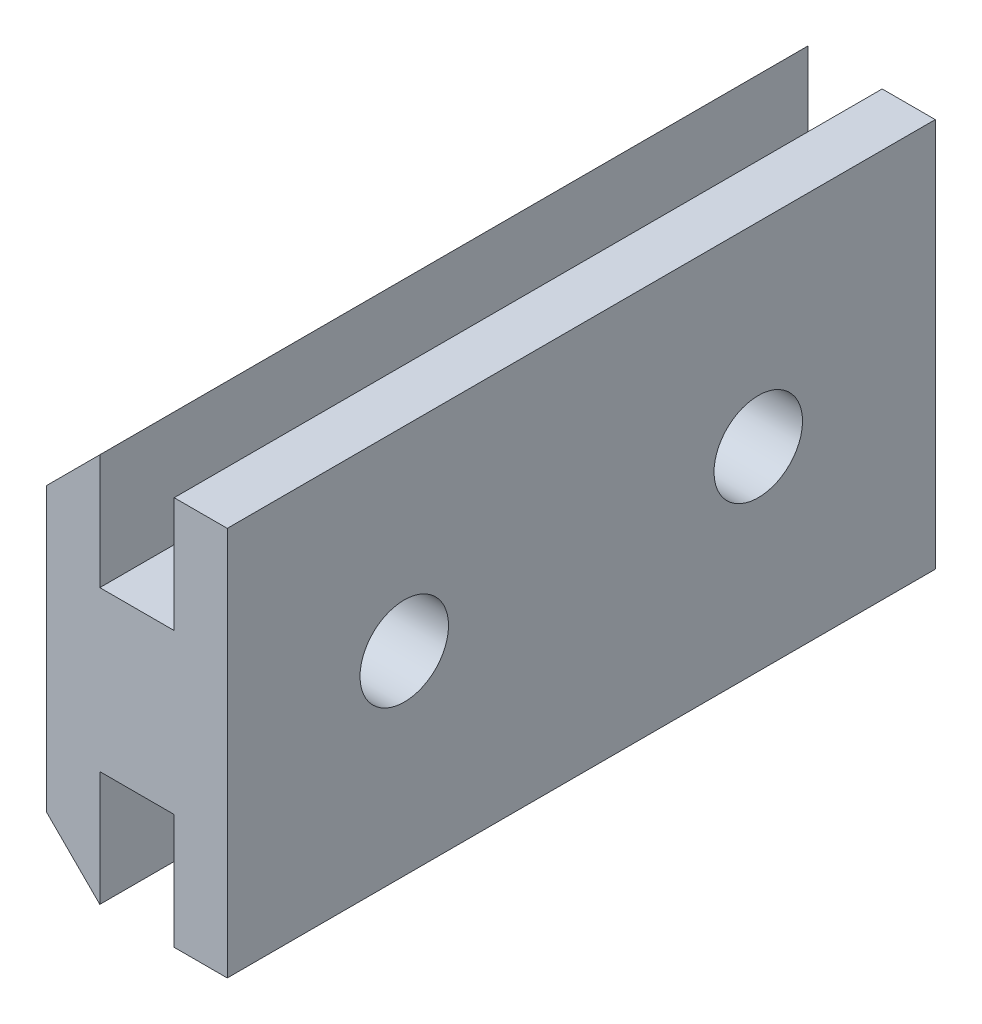
ISO-10303-21;
HEADER;
FILE_DESCRIPTION(('STEP AP214'),'2;1');
FILE_NAME('part.step','',(''),(''),'','','');
FILE_SCHEMA(('AUTOMOTIVE_DESIGN { 1 0 10303 214 1 1 1 1 }'));
ENDSEC;
DATA;
#1=APPLICATION_CONTEXT('core data for automotive mechanical design processes');
#2=APPLICATION_PROTOCOL_DEFINITION('international standard','automotive_design',2000,#1);
#3=PRODUCT_CONTEXT('',#1,'mechanical');
#4=PRODUCT('Part','Part','',(#3));
#5=PRODUCT_RELATED_PRODUCT_CATEGORY('part','',(#4));
#6=PRODUCT_DEFINITION_FORMATION('','',#4);
#7=PRODUCT_DEFINITION_CONTEXT('part definition',#1,'design');
#8=PRODUCT_DEFINITION('design','',#6,#7);
#9=PRODUCT_DEFINITION_SHAPE('','',#8);
#10=(LENGTH_UNIT() NAMED_UNIT(*) SI_UNIT(.MILLI.,.METRE.));
#11=(NAMED_UNIT(*) PLANE_ANGLE_UNIT() SI_UNIT($,.RADIAN.));
#12=(NAMED_UNIT(*) SI_UNIT($,.STERADIAN.) SOLID_ANGLE_UNIT());
#13=UNCERTAINTY_MEASURE_WITH_UNIT(LENGTH_MEASURE(1.E-05),#10,'distance_accuracy_value','');
#14=(GEOMETRIC_REPRESENTATION_CONTEXT(3) GLOBAL_UNCERTAINTY_ASSIGNED_CONTEXT((#13)) GLOBAL_UNIT_ASSIGNED_CONTEXT((#10,
#11,#12)) REPRESENTATION_CONTEXT('',''));
#15=CARTESIAN_POINT('',(0.,0.,0.));
#16=DIRECTION('',(0.,0.,1.));
#17=DIRECTION('',(1.,0.,0.));
#18=AXIS2_PLACEMENT_3D('',#15,#16,#17);
#19=CARTESIAN_POINT('',(0.100000000000002,-1.75000000000001,20.));
#20=DIRECTION('',(0.707106781186546,0.707106781186549,0.));
#21=DIRECTION('',(-0.707106781186549,0.707106781186546,0.));
#22=AXIS2_PLACEMENT_3D('',#19,#20,#21);
#23=PLANE('',#22);
#24=DIRECTION('',(0.707106781186549,-0.707106781186546,0.));
#25=VECTOR('',#24,1.);
#26=CARTESIAN_POINT('',(0.100000000000002,-1.75000000000001,0.));
#27=LINE('',#26,#25);
#28=CARTESIAN_POINT('',(0.100000000000002,-1.75000000000001,0.));
#29=VERTEX_POINT('',#28);
#30=CARTESIAN_POINT('',(1.6,-3.25,0.));
#31=VERTEX_POINT('',#30);
#32=EDGE_CURVE('E153',#29,#31,#27,.T.);
#33=ORIENTED_EDGE('',*,*,#32,.T.);
#34=DIRECTION('',(0.,0.,-1.));
#35=VECTOR('',#34,1.);
#36=CARTESIAN_POINT('',(1.6,-3.25,20.));
#37=LINE('',#36,#35);
#38=CARTESIAN_POINT('',(1.6,-3.25,20.));
#39=VERTEX_POINT('',#38);
#40=EDGE_CURVE('E11',#39,#31,#37,.T.);
#41=ORIENTED_EDGE('',*,*,#40,.F.);
#42=DIRECTION('',(0.707106781186549,-0.707106781186546,0.));
#43=VECTOR('',#42,1.);
#44=CARTESIAN_POINT('',(0.100000000000002,-1.75000000000001,20.));
#45=LINE('',#44,#43);
#46=CARTESIAN_POINT('',(0.100000000000002,-1.75000000000001,20.));
#47=VERTEX_POINT('',#46);
#48=EDGE_CURVE('E176',#47,#39,#45,.T.);
#49=ORIENTED_EDGE('',*,*,#48,.F.);
#50=DIRECTION('',(0.,0.,-1.));
#51=VECTOR('',#50,1.);
#52=CARTESIAN_POINT('',(0.100000000000002,-1.75000000000001,20.));
#53=LINE('',#52,#51);
#54=EDGE_CURVE('E149',#47,#29,#53,.T.);
#55=ORIENTED_EDGE('',*,*,#54,.T.);
#56=EDGE_LOOP('',(#33,#41,#49,#55));
#57=FACE_BOUND('',#56,.T.);
#58=ADVANCED_FACE('F33',(#57),#23,.F.);
#59=CARTESIAN_POINT('',(1.6,0.,20.));
#60=DIRECTION('',(-1.,0.,0.));
#61=DIRECTION('',(0.,-1.,0.));
#62=AXIS2_PLACEMENT_3D('',#59,#60,#61);
#63=PLANE('',#62);
#64=DIRECTION('',(0.,1.,0.));
#65=VECTOR('',#64,1.);
#66=CARTESIAN_POINT('',(1.6,0.,0.));
#67=LINE('',#66,#65);
#68=CARTESIAN_POINT('',(1.6,0.,0.));
#69=VERTEX_POINT('',#68);
#70=EDGE_CURVE('E156',#31,#69,#67,.T.);
#71=ORIENTED_EDGE('',*,*,#70,.T.);
#72=DIRECTION('',(0.,0.,-1.));
#73=VECTOR('',#72,1.);
#74=CARTESIAN_POINT('',(1.6,0.,20.));
#75=LINE('',#74,#73);
#76=CARTESIAN_POINT('',(1.6,0.,20.));
#77=VERTEX_POINT('',#76);
#78=EDGE_CURVE('E41',#77,#69,#75,.T.);
#79=ORIENTED_EDGE('',*,*,#78,.F.);
#80=DIRECTION('',(0.,1.,0.));
#81=VECTOR('',#80,1.);
#82=CARTESIAN_POINT('',(1.6,0.,20.));
#83=LINE('',#82,#81);
#84=EDGE_CURVE('E104',#39,#77,#83,.T.);
#85=ORIENTED_EDGE('',*,*,#84,.F.);
#86=ORIENTED_EDGE('',*,*,#40,.T.);
#87=EDGE_LOOP('',(#71,#79,#85,#86));
#88=FACE_BOUND('',#87,.T.);
#89=ADVANCED_FACE('F257',(#88),#63,.F.);
#90=CARTESIAN_POINT('',(3.7,0.,20.));
#91=DIRECTION('',(0.,1.,0.));
#92=DIRECTION('',(0.,0.,1.));
#93=AXIS2_PLACEMENT_3D('',#90,#91,#92);
#94=PLANE('',#93);
#95=DIRECTION('',(1.,0.,0.));
#96=VECTOR('',#95,1.);
#97=CARTESIAN_POINT('',(3.7,0.,0.));
#98=LINE('',#97,#96);
#99=CARTESIAN_POINT('',(3.7,0.,0.));
#100=VERTEX_POINT('',#99);
#101=EDGE_CURVE('E159',#69,#100,#98,.T.);
#102=ORIENTED_EDGE('',*,*,#101,.T.);
#103=DIRECTION('',(0.,0.,-1.));
#104=VECTOR('',#103,1.);
#105=CARTESIAN_POINT('',(3.7,0.,20.));
#106=LINE('',#105,#104);
#107=CARTESIAN_POINT('',(3.7,0.,20.));
#108=VERTEX_POINT('',#107);
#109=EDGE_CURVE('E195',#108,#100,#106,.T.);
#110=ORIENTED_EDGE('',*,*,#109,.F.);
#111=DIRECTION('',(1.,0.,0.));
#112=VECTOR('',#111,1.);
#113=CARTESIAN_POINT('',(3.7,0.,20.));
#114=LINE('',#113,#112);
#115=EDGE_CURVE('E203',#77,#108,#114,.T.);
#116=ORIENTED_EDGE('',*,*,#115,.F.);
#117=ORIENTED_EDGE('',*,*,#78,.T.);
#118=EDGE_LOOP('',(#102,#110,#116,#117));
#119=FACE_BOUND('',#118,.T.);
#120=ADVANCED_FACE('F201',(#119),#94,.F.);
#121=CARTESIAN_POINT('',(3.7,-3.25,20.));
#122=DIRECTION('',(1.,0.,0.));
#123=DIRECTION('',(0.,0.,-1.));
#124=AXIS2_PLACEMENT_3D('',#121,#122,#123);
#125=PLANE('',#124);
#126=DIRECTION('',(0.,-1.,0.));
#127=VECTOR('',#126,1.);
#128=CARTESIAN_POINT('',(3.7,-3.25,0.));
#129=LINE('',#128,#127);
#130=CARTESIAN_POINT('',(3.7,-3.25,0.));
#131=VERTEX_POINT('',#130);
#132=EDGE_CURVE('E161',#100,#131,#129,.T.);
#133=ORIENTED_EDGE('',*,*,#132,.T.);
#134=DIRECTION('',(0.,0.,-1.));
#135=VECTOR('',#134,1.);
#136=CARTESIAN_POINT('',(3.7,-3.25,20.));
#137=LINE('',#136,#135);
#138=CARTESIAN_POINT('',(3.7,-3.25,20.));
#139=VERTEX_POINT('',#138);
#140=EDGE_CURVE('E192',#139,#131,#137,.T.);
#141=ORIENTED_EDGE('',*,*,#140,.F.);
#142=DIRECTION('',(0.,-1.,0.));
#143=VECTOR('',#142,1.);
#144=CARTESIAN_POINT('',(3.7,-3.25,20.));
#145=LINE('',#144,#143);
#146=EDGE_CURVE('E221',#108,#139,#145,.T.);
#147=ORIENTED_EDGE('',*,*,#146,.F.);
#148=ORIENTED_EDGE('',*,*,#109,.T.);
#149=EDGE_LOOP('',(#133,#141,#147,#148));
#150=FACE_BOUND('',#149,.T.);
#151=ADVANCED_FACE('F212',(#150),#125,.F.);
#152=CARTESIAN_POINT('',(5.2,-3.25,20.));
#153=DIRECTION('',(0.,1.,0.));
#154=DIRECTION('',(0.,0.,1.));
#155=AXIS2_PLACEMENT_3D('',#152,#153,#154);
#156=PLANE('',#155);
#157=DIRECTION('',(1.,0.,0.));
#158=VECTOR('',#157,1.);
#159=CARTESIAN_POINT('',(5.2,-3.25,0.));
#160=LINE('',#159,#158);
#161=CARTESIAN_POINT('',(5.2,-3.25,0.));
#162=VERTEX_POINT('',#161);
#163=EDGE_CURVE('E163',#131,#162,#160,.T.);
#164=ORIENTED_EDGE('',*,*,#163,.T.);
#165=DIRECTION('',(0.,0.,-1.));
#166=VECTOR('',#165,1.);
#167=CARTESIAN_POINT('',(5.2,-3.25,20.));
#168=LINE('',#167,#166);
#169=CARTESIAN_POINT('',(5.2,-3.25,20.));
#170=VERTEX_POINT('',#169);
#171=EDGE_CURVE('E189',#170,#162,#168,.T.);
#172=ORIENTED_EDGE('',*,*,#171,.F.);
#173=DIRECTION('',(1.,0.,0.));
#174=VECTOR('',#173,1.);
#175=CARTESIAN_POINT('',(5.2,-3.25,20.));
#176=LINE('',#175,#174);
#177=EDGE_CURVE('E218',#139,#170,#176,.T.);
#178=ORIENTED_EDGE('',*,*,#177,.F.);
#179=ORIENTED_EDGE('',*,*,#140,.T.);
#180=EDGE_LOOP('',(#164,#172,#178,#179));
#181=FACE_BOUND('',#180,.T.);
#182=ADVANCED_FACE('F216',(#181),#156,.F.);
#183=CARTESIAN_POINT('',(5.2,7.75,20.));
#184=DIRECTION('',(-1.,0.,0.));
#185=DIRECTION('',(0.,-1.,0.));
#186=AXIS2_PLACEMENT_3D('',#183,#184,#185);
#187=PLANE('',#186);
#188=CARTESIAN_POINT('',(5.2,2.25,5.));
#189=DIRECTION('',(1.,0.,0.));
#190=DIRECTION('',(0.,1.,0.));
#191=AXIS2_PLACEMENT_3D('',#188,#189,#190);
#192=CIRCLE('',#191,1.25);
#193=CARTESIAN_POINT('',(5.2,3.5,5.));
#194=VERTEX_POINT('',#193);
#195=EDGE_CURVE('E345',#194,#194,#192,.T.);
#196=ORIENTED_EDGE('',*,*,#195,.F.);
#197=EDGE_LOOP('',(#196));
#198=FACE_BOUND('',#197,.T.);
#199=CARTESIAN_POINT('',(5.2,2.25,15.));
#200=DIRECTION('',(1.,0.,0.));
#201=DIRECTION('',(0.,1.,0.));
#202=AXIS2_PLACEMENT_3D('',#199,#200,#201);
#203=CIRCLE('',#202,1.25);
#204=CARTESIAN_POINT('',(5.2,3.5,15.));
#205=VERTEX_POINT('',#204);
#206=EDGE_CURVE('E347',#205,#205,#203,.T.);
#207=ORIENTED_EDGE('',*,*,#206,.F.);
#208=EDGE_LOOP('',(#207));
#209=FACE_BOUND('',#208,.T.);
#210=DIRECTION('',(0.,1.,0.));
#211=VECTOR('',#210,1.);
#212=CARTESIAN_POINT('',(5.2,7.75,0.));
#213=LINE('',#212,#211);
#214=CARTESIAN_POINT('',(5.2,7.75,0.));
#215=VERTEX_POINT('',#214);
#216=EDGE_CURVE('E165',#162,#215,#213,.T.);
#217=ORIENTED_EDGE('',*,*,#216,.T.);
#218=DIRECTION('',(0.,0.,-1.));
#219=VECTOR('',#218,1.);
#220=CARTESIAN_POINT('',(5.2,7.75,20.));
#221=LINE('',#220,#219);
#222=CARTESIAN_POINT('',(5.2,7.75,20.));
#223=VERTEX_POINT('',#222);
#224=EDGE_CURVE('E186',#223,#215,#221,.T.);
#225=ORIENTED_EDGE('',*,*,#224,.F.);
#226=DIRECTION('',(0.,1.,0.));
#227=VECTOR('',#226,1.);
#228=CARTESIAN_POINT('',(5.2,7.75,20.));
#229=LINE('',#228,#227);
#230=EDGE_CURVE('E220',#170,#223,#229,.T.);
#231=ORIENTED_EDGE('',*,*,#230,.F.);
#232=ORIENTED_EDGE('',*,*,#171,.T.);
#233=EDGE_LOOP('',(#217,#225,#231,#232));
#234=FACE_BOUND('',#233,.T.);
#235=ADVANCED_FACE('F270',(#198,#209,#234),#187,.F.);
#236=CARTESIAN_POINT('',(3.7,7.75,20.));
#237=DIRECTION('',(0.,-1.,0.));
#238=DIRECTION('',(0.,0.,-1.));
#239=AXIS2_PLACEMENT_3D('',#236,#237,#238);
#240=PLANE('',#239);
#241=DIRECTION('',(-1.,0.,0.));
#242=VECTOR('',#241,1.);
#243=CARTESIAN_POINT('',(3.7,7.75,0.));
#244=LINE('',#243,#242);
#245=CARTESIAN_POINT('',(3.7,7.75,0.));
#246=VERTEX_POINT('',#245);
#247=EDGE_CURVE('E167',#215,#246,#244,.T.);
#248=ORIENTED_EDGE('',*,*,#247,.T.);
#249=DIRECTION('',(0.,0.,-1.));
#250=VECTOR('',#249,1.);
#251=CARTESIAN_POINT('',(3.7,7.75,20.));
#252=LINE('',#251,#250);
#253=CARTESIAN_POINT('',(3.7,7.75,20.));
#254=VERTEX_POINT('',#253);
#255=EDGE_CURVE('E183',#254,#246,#252,.T.);
#256=ORIENTED_EDGE('',*,*,#255,.F.);
#257=DIRECTION('',(-1.,0.,0.));
#258=VECTOR('',#257,1.);
#259=CARTESIAN_POINT('',(3.7,7.75,20.));
#260=LINE('',#259,#258);
#261=EDGE_CURVE('E223',#223,#254,#260,.T.);
#262=ORIENTED_EDGE('',*,*,#261,.F.);
#263=ORIENTED_EDGE('',*,*,#224,.T.);
#264=EDGE_LOOP('',(#248,#256,#262,#263));
#265=FACE_BOUND('',#264,.T.);
#266=ADVANCED_FACE('F273',(#265),#240,.F.);
#267=CARTESIAN_POINT('',(3.7,4.5,20.));
#268=DIRECTION('',(1.,0.,0.));
#269=DIRECTION('',(0.,0.,-1.));
#270=AXIS2_PLACEMENT_3D('',#267,#268,#269);
#271=PLANE('',#270);
#272=DIRECTION('',(0.,-1.,0.));
#273=VECTOR('',#272,1.);
#274=CARTESIAN_POINT('',(3.7,4.5,0.));
#275=LINE('',#274,#273);
#276=CARTESIAN_POINT('',(3.7,4.5,0.));
#277=VERTEX_POINT('',#276);
#278=EDGE_CURVE('E169',#246,#277,#275,.T.);
#279=ORIENTED_EDGE('',*,*,#278,.T.);
#280=DIRECTION('',(0.,0.,-1.));
#281=VECTOR('',#280,1.);
#282=CARTESIAN_POINT('',(3.7,4.5,20.));
#283=LINE('',#282,#281);
#284=CARTESIAN_POINT('',(3.7,4.5,20.));
#285=VERTEX_POINT('',#284);
#286=EDGE_CURVE('E180',#285,#277,#283,.T.);
#287=ORIENTED_EDGE('',*,*,#286,.F.);
#288=DIRECTION('',(0.,-1.,0.));
#289=VECTOR('',#288,1.);
#290=CARTESIAN_POINT('',(3.7,4.5,20.));
#291=LINE('',#290,#289);
#292=EDGE_CURVE('E229',#254,#285,#291,.T.);
#293=ORIENTED_EDGE('',*,*,#292,.F.);
#294=ORIENTED_EDGE('',*,*,#255,.T.);
#295=EDGE_LOOP('',(#279,#287,#293,#294));
#296=FACE_BOUND('',#295,.T.);
#297=ADVANCED_FACE('F235',(#296),#271,.F.);
#298=CARTESIAN_POINT('',(1.6,4.5,20.));
#299=DIRECTION('',(0.,-1.,0.));
#300=DIRECTION('',(0.,0.,-1.));
#301=AXIS2_PLACEMENT_3D('',#298,#299,#300);
#302=PLANE('',#301);
#303=DIRECTION('',(-1.,0.,0.));
#304=VECTOR('',#303,1.);
#305=CARTESIAN_POINT('',(1.6,4.5,0.));
#306=LINE('',#305,#304);
#307=CARTESIAN_POINT('',(1.6,4.5,0.));
#308=VERTEX_POINT('',#307);
#309=EDGE_CURVE('E171',#277,#308,#306,.T.);
#310=ORIENTED_EDGE('',*,*,#309,.T.);
#311=DIRECTION('',(0.,0.,-1.));
#312=VECTOR('',#311,1.);
#313=CARTESIAN_POINT('',(1.6,4.5,20.));
#314=LINE('',#313,#312);
#315=CARTESIAN_POINT('',(1.6,4.5,20.));
#316=VERTEX_POINT('',#315);
#317=EDGE_CURVE('E144',#316,#308,#314,.T.);
#318=ORIENTED_EDGE('',*,*,#317,.F.);
#319=DIRECTION('',(-1.,0.,0.));
#320=VECTOR('',#319,1.);
#321=CARTESIAN_POINT('',(1.6,4.5,20.));
#322=LINE('',#321,#320);
#323=EDGE_CURVE('E135',#285,#316,#322,.T.);
#324=ORIENTED_EDGE('',*,*,#323,.F.);
#325=ORIENTED_EDGE('',*,*,#286,.T.);
#326=EDGE_LOOP('',(#310,#318,#324,#325));
#327=FACE_BOUND('',#326,.T.);
#328=ADVANCED_FACE('F239',(#327),#302,.F.);
#329=CARTESIAN_POINT('',(1.6,7.75,20.));
#330=DIRECTION('',(-1.,0.,0.));
#331=DIRECTION('',(0.,0.,1.));
#332=AXIS2_PLACEMENT_3D('',#329,#330,#331);
#333=PLANE('',#332);
#334=DIRECTION('',(0.,1.,0.));
#335=VECTOR('',#334,1.);
#336=CARTESIAN_POINT('',(1.6,7.75,0.));
#337=LINE('',#336,#335);
#338=CARTESIAN_POINT('',(1.6,7.75,0.));
#339=VERTEX_POINT('',#338);
#340=EDGE_CURVE('E143',#308,#339,#337,.T.);
#341=ORIENTED_EDGE('',*,*,#340,.T.);
#342=DIRECTION('',(0.,0.,-1.));
#343=VECTOR('',#342,1.);
#344=CARTESIAN_POINT('',(1.6,7.75,20.));
#345=LINE('',#344,#343);
#346=CARTESIAN_POINT('',(1.6,7.75,20.));
#347=VERTEX_POINT('',#346);
#348=EDGE_CURVE('E140',#347,#339,#345,.T.);
#349=ORIENTED_EDGE('',*,*,#348,.F.);
#350=DIRECTION('',(0.,1.,0.));
#351=VECTOR('',#350,1.);
#352=CARTESIAN_POINT('',(1.6,7.75,20.));
#353=LINE('',#352,#351);
#354=EDGE_CURVE('E129',#316,#347,#353,.T.);
#355=ORIENTED_EDGE('',*,*,#354,.F.);
#356=ORIENTED_EDGE('',*,*,#317,.T.);
#357=EDGE_LOOP('',(#341,#349,#355,#356));
#358=FACE_BOUND('',#357,.T.);
#359=ADVANCED_FACE('F141',(#358),#333,.F.);
#360=CARTESIAN_POINT('',(0.100000000000002,6.25000000000001,20.));
#361=DIRECTION('',(0.707106781186546,-0.707106781186549,0.));
#362=DIRECTION('',(0.707106781186549,0.707106781186546,0.));
#363=AXIS2_PLACEMENT_3D('',#360,#361,#362);
#364=PLANE('',#363);
#365=DIRECTION('',(-0.707106781186549,-0.707106781186546,0.));
#366=VECTOR('',#365,1.);
#367=CARTESIAN_POINT('',(0.100000000000002,6.25000000000001,0.));
#368=LINE('',#367,#366);
#369=CARTESIAN_POINT('',(0.100000000000002,6.25000000000001,0.));
#370=VERTEX_POINT('',#369);
#371=EDGE_CURVE('E90',#339,#370,#368,.T.);
#372=ORIENTED_EDGE('',*,*,#371,.T.);
#373=DIRECTION('',(0.,0.,-1.));
#374=VECTOR('',#373,1.);
#375=CARTESIAN_POINT('',(0.100000000000002,6.25000000000001,20.));
#376=LINE('',#375,#374);
#377=CARTESIAN_POINT('',(0.100000000000002,6.25000000000001,20.));
#378=VERTEX_POINT('',#377);
#379=EDGE_CURVE('E145',#378,#370,#376,.T.);
#380=ORIENTED_EDGE('',*,*,#379,.F.);
#381=DIRECTION('',(-0.707106781186549,-0.707106781186546,0.));
#382=VECTOR('',#381,1.);
#383=CARTESIAN_POINT('',(0.100000000000002,6.25000000000001,20.));
#384=LINE('',#383,#382);
#385=EDGE_CURVE('E133',#347,#378,#384,.T.);
#386=ORIENTED_EDGE('',*,*,#385,.F.);
#387=ORIENTED_EDGE('',*,*,#348,.T.);
#388=EDGE_LOOP('',(#372,#380,#386,#387));
#389=FACE_BOUND('',#388,.T.);
#390=ADVANCED_FACE('F147',(#389),#364,.F.);
#391=CARTESIAN_POINT('',(0.100000000000002,-1.75000000000001,20.));
#392=DIRECTION('',(1.,0.,0.));
#393=DIRECTION('',(0.,1.,0.));
#394=AXIS2_PLACEMENT_3D('',#391,#392,#393);
#395=PLANE('',#394);
#396=CARTESIAN_POINT('',(0.100000000000001,2.25,5.));
#397=DIRECTION('',(1.,0.,0.));
#398=DIRECTION('',(0.,1.,0.));
#399=AXIS2_PLACEMENT_3D('',#396,#397,#398);
#400=CIRCLE('',#399,1.25);
#401=CARTESIAN_POINT('',(0.100000000000001,3.5,5.));
#402=VERTEX_POINT('',#401);
#403=EDGE_CURVE('E342',#402,#402,#400,.T.);
#404=ORIENTED_EDGE('',*,*,#403,.T.);
#405=EDGE_LOOP('',(#404));
#406=FACE_BOUND('',#405,.T.);
#407=CARTESIAN_POINT('',(0.100000000000001,2.25,15.));
#408=DIRECTION('',(1.,0.,0.));
#409=DIRECTION('',(0.,1.,0.));
#410=AXIS2_PLACEMENT_3D('',#407,#408,#409);
#411=CIRCLE('',#410,1.25);
#412=CARTESIAN_POINT('',(0.100000000000001,3.5,15.));
#413=VERTEX_POINT('',#412);
#414=EDGE_CURVE('E157',#413,#413,#411,.T.);
#415=ORIENTED_EDGE('',*,*,#414,.T.);
#416=EDGE_LOOP('',(#415));
#417=FACE_BOUND('',#416,.T.);
#418=DIRECTION('',(0.,-1.,0.));
#419=VECTOR('',#418,1.);
#420=CARTESIAN_POINT('',(0.100000000000002,-1.75000000000001,0.));
#421=LINE('',#420,#419);
#422=EDGE_CURVE('E96',#370,#29,#421,.T.);
#423=ORIENTED_EDGE('',*,*,#422,.T.);
#424=ORIENTED_EDGE('',*,*,#54,.F.);
#425=DIRECTION('',(0.,-1.,0.));
#426=VECTOR('',#425,1.);
#427=CARTESIAN_POINT('',(0.100000000000002,-1.75000000000001,20.));
#428=LINE('',#427,#426);
#429=EDGE_CURVE('E49',#378,#47,#428,.T.);
#430=ORIENTED_EDGE('',*,*,#429,.F.);
#431=ORIENTED_EDGE('',*,*,#379,.T.);
#432=EDGE_LOOP('',(#423,#424,#430,#431));
#433=FACE_BOUND('',#432,.T.);
#434=ADVANCED_FACE('F243',(#406,#417,#433),#395,.F.);
#435=CARTESIAN_POINT('',(0.,0.,20.));
#436=DIRECTION('',(0.,0.,1.));
#437=DIRECTION('',(1.,0.,0.));
#438=AXIS2_PLACEMENT_3D('',#435,#436,#437);
#439=PLANE('',#438);
#440=ORIENTED_EDGE('',*,*,#48,.T.);
#441=ORIENTED_EDGE('',*,*,#84,.T.);
#442=ORIENTED_EDGE('',*,*,#115,.T.);
#443=ORIENTED_EDGE('',*,*,#146,.T.);
#444=ORIENTED_EDGE('',*,*,#177,.T.);
#445=ORIENTED_EDGE('',*,*,#230,.T.);
#446=ORIENTED_EDGE('',*,*,#261,.T.);
#447=ORIENTED_EDGE('',*,*,#292,.T.);
#448=ORIENTED_EDGE('',*,*,#323,.T.);
#449=ORIENTED_EDGE('',*,*,#354,.T.);
#450=ORIENTED_EDGE('',*,*,#385,.T.);
#451=ORIENTED_EDGE('',*,*,#429,.T.);
#452=EDGE_LOOP('',(#440,#441,#442,#443,#444,#445,#446,#447,#448,#449,#450,#451));
#453=FACE_BOUND('',#452,.T.);
#454=ADVANCED_FACE('F131',(#453),#439,.T.);
#455=CARTESIAN_POINT('',(0.,0.,0.));
#456=DIRECTION('',(0.,0.,1.));
#457=DIRECTION('',(1.,0.,0.));
#458=AXIS2_PLACEMENT_3D('',#455,#456,#457);
#459=PLANE('',#458);
#460=ORIENTED_EDGE('',*,*,#32,.F.);
#461=ORIENTED_EDGE('',*,*,#422,.F.);
#462=ORIENTED_EDGE('',*,*,#371,.F.);
#463=ORIENTED_EDGE('',*,*,#340,.F.);
#464=ORIENTED_EDGE('',*,*,#309,.F.);
#465=ORIENTED_EDGE('',*,*,#278,.F.);
#466=ORIENTED_EDGE('',*,*,#247,.F.);
#467=ORIENTED_EDGE('',*,*,#216,.F.);
#468=ORIENTED_EDGE('',*,*,#163,.F.);
#469=ORIENTED_EDGE('',*,*,#132,.F.);
#470=ORIENTED_EDGE('',*,*,#101,.F.);
#471=ORIENTED_EDGE('',*,*,#70,.F.);
#472=EDGE_LOOP('',(#460,#461,#462,#463,#464,#465,#466,#467,#468,#469,#470,#471));
#473=FACE_BOUND('',#472,.T.);
#474=ADVANCED_FACE('F207',(#473),#459,.F.);
#475=CARTESIAN_POINT('',(0.100000000000001,2.25,15.));
#476=DIRECTION('',(1.,0.,0.));
#477=DIRECTION('',(0.,1.,0.));
#478=AXIS2_PLACEMENT_3D('',#475,#476,#477);
#479=CYLINDRICAL_SURFACE('',#478,1.25);
#480=ORIENTED_EDGE('',*,*,#414,.F.);
#481=EDGE_LOOP('',(#480));
#482=FACE_BOUND('',#481,.T.);
#483=ORIENTED_EDGE('',*,*,#206,.T.);
#484=EDGE_LOOP('',(#483));
#485=FACE_BOUND('',#484,.T.);
#486=ADVANCED_FACE('F307',(#482,#485),#479,.F.);
#487=CARTESIAN_POINT('',(0.100000000000001,2.25,5.));
#488=DIRECTION('',(1.,0.,0.));
#489=DIRECTION('',(0.,1.,0.));
#490=AXIS2_PLACEMENT_3D('',#487,#488,#489);
#491=CYLINDRICAL_SURFACE('',#490,1.25);
#492=ORIENTED_EDGE('',*,*,#403,.F.);
#493=EDGE_LOOP('',(#492));
#494=FACE_BOUND('',#493,.T.);
#495=ORIENTED_EDGE('',*,*,#195,.T.);
#496=EDGE_LOOP('',(#495));
#497=FACE_BOUND('',#496,.T.);
#498=ADVANCED_FACE('F326',(#494,#497),#491,.F.);
#499=CLOSED_SHELL('',(#58,#89,#120,#151,#182,#235,#266,#297,#328,#359,#390,#434,#454,#474,#486,#498));
#500=MANIFOLD_SOLID_BREP('B2',#499);
#501=ADVANCED_BREP_SHAPE_REPRESENTATION('',(#18,#500),#14);
#502=SHAPE_DEFINITION_REPRESENTATION(#9,#501);
ENDSEC;
END-ISO-10303-21;
